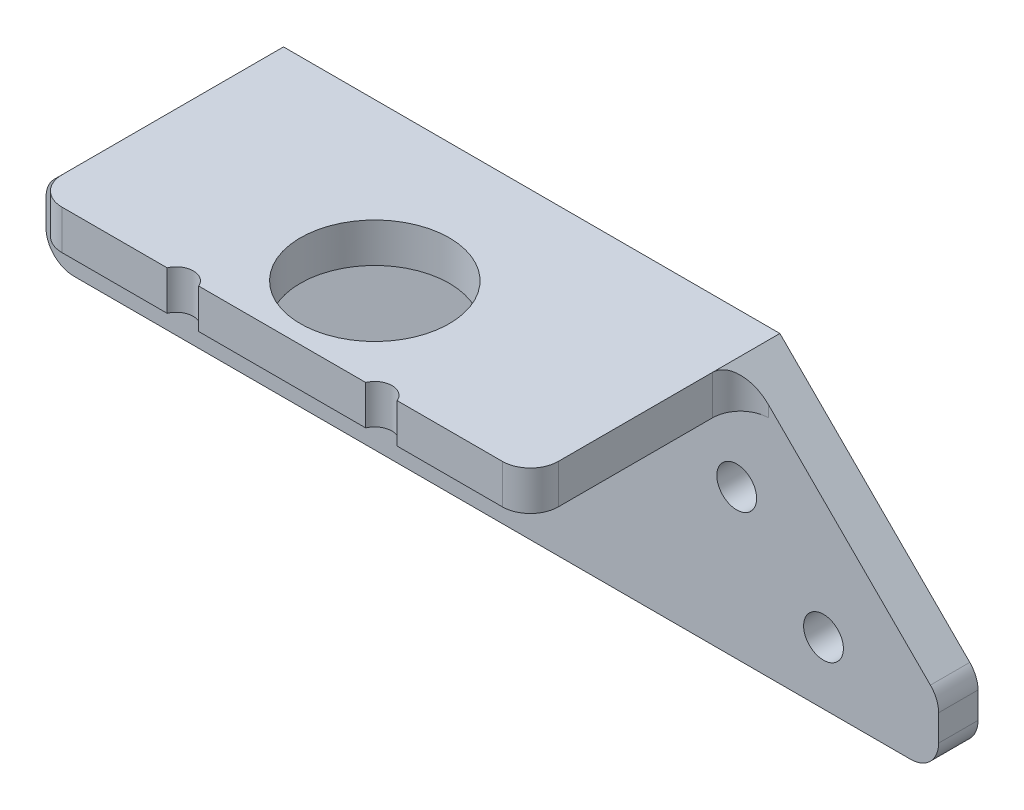
ISO-10303-21;
HEADER;
FILE_DESCRIPTION(('STEP AP214'),'2;1');
FILE_NAME('part.step','',(''),(''),'','','');
FILE_SCHEMA(('AUTOMOTIVE_DESIGN { 1 0 10303 214 1 1 1 1 }'));
ENDSEC;
DATA;
#1=APPLICATION_CONTEXT('core data for automotive mechanical design processes');
#2=APPLICATION_PROTOCOL_DEFINITION('international standard','automotive_design',2000,#1);
#3=PRODUCT_CONTEXT('',#1,'mechanical');
#4=PRODUCT('Part','Part','',(#3));
#5=PRODUCT_RELATED_PRODUCT_CATEGORY('part','',(#4));
#6=PRODUCT_DEFINITION_FORMATION('','',#4);
#7=PRODUCT_DEFINITION_CONTEXT('part definition',#1,'design');
#8=PRODUCT_DEFINITION('design','',#6,#7);
#9=PRODUCT_DEFINITION_SHAPE('','',#8);
#10=(LENGTH_UNIT() NAMED_UNIT(*) SI_UNIT(.MILLI.,.METRE.));
#11=(NAMED_UNIT(*) PLANE_ANGLE_UNIT() SI_UNIT($,.RADIAN.));
#12=(NAMED_UNIT(*) SI_UNIT($,.STERADIAN.) SOLID_ANGLE_UNIT());
#13=UNCERTAINTY_MEASURE_WITH_UNIT(LENGTH_MEASURE(1.E-05),#10,'distance_accuracy_value','');
#14=(GEOMETRIC_REPRESENTATION_CONTEXT(3) GLOBAL_UNCERTAINTY_ASSIGNED_CONTEXT((#13)) GLOBAL_UNIT_ASSIGNED_CONTEXT((#10,
#11,#12)) REPRESENTATION_CONTEXT('',''));
#15=CARTESIAN_POINT('',(0.,0.,0.));
#16=DIRECTION('',(0.,0.,1.));
#17=DIRECTION('',(1.,0.,0.));
#18=AXIS2_PLACEMENT_3D('',#15,#16,#17);
#19=CARTESIAN_POINT('',(0.,0.,24.05));
#20=DIRECTION('',(0.,0.,-1.));
#21=DIRECTION('',(-1.,0.,0.));
#22=AXIS2_PLACEMENT_3D('',#19,#20,#21);
#23=PLANE('',#22);
#24=DIRECTION('',(-1.,0.,0.));
#25=VECTOR('',#24,1.);
#26=CARTESIAN_POINT('',(-21.2299808242143,3.57187500000001,24.05));
#27=LINE('',#26,#25);
#28=CARTESIAN_POINT('',(8.8417525744906,3.57187500000001,24.05));
#29=VERTEX_POINT('',#28);
#30=CARTESIAN_POINT('',(-6.30171422291922,3.57187500000001,24.05));
#31=VERTEX_POINT('',#30);
#32=EDGE_CURVE('E196',#29,#31,#27,.T.);
#33=ORIENTED_EDGE('',*,*,#32,.T.);
#34=DIRECTION('',(0.,-1.,0.));
#35=VECTOR('',#34,1.);
#36=CARTESIAN_POINT('',(-6.30171422291922,3.57187500000001,24.05));
#37=LINE('',#36,#35);
#38=CARTESIAN_POINT('',(-6.30171422291922,0.,24.05));
#39=VERTEX_POINT('',#38);
#40=EDGE_CURVE('E11',#31,#39,#37,.T.);
#41=ORIENTED_EDGE('',*,*,#40,.T.);
#42=DIRECTION('',(1.,0.,0.));
#43=VECTOR('',#42,1.);
#44=CARTESIAN_POINT('',(23.7700191757857,0.,24.05));
#45=LINE('',#44,#43);
#46=CARTESIAN_POINT('',(8.84175257449061,0.,24.05));
#47=VERTEX_POINT('',#46);
#48=EDGE_CURVE('E205',#39,#47,#45,.T.);
#49=ORIENTED_EDGE('',*,*,#48,.T.);
#50=DIRECTION('',(0.,-1.,0.));
#51=VECTOR('',#50,1.);
#52=CARTESIAN_POINT('',(8.84175257449061,3.57187500000001,24.05));
#53=LINE('',#52,#51);
#54=EDGE_CURVE('E187',#47,#29,#53,.F.);
#55=ORIENTED_EDGE('',*,*,#54,.T.);
#56=EDGE_LOOP('',(#33,#41,#49,#55));
#57=FACE_BOUND('',#56,.T.);
#58=ADVANCED_FACE('F38',(#57),#23,.F.);
#59=CARTESIAN_POINT('',(21.2300191757857,3.57187500000001,24.05));
#60=VERTEX_POINT('',#59);
#61=CARTESIAN_POINT('',(11.6982857770808,3.57187500000001,24.05));
#62=VERTEX_POINT('',#61);
#63=EDGE_CURVE('E194',#60,#62,#27,.T.);
#64=ORIENTED_EDGE('',*,*,#63,.T.);
#65=DIRECTION('',(0.,-1.,0.));
#66=VECTOR('',#65,1.);
#67=CARTESIAN_POINT('',(11.6982857770808,3.57187500000001,24.05));
#68=LINE('',#67,#66);
#69=CARTESIAN_POINT('',(11.6982857770808,0.,24.05));
#70=VERTEX_POINT('',#69);
#71=EDGE_CURVE('E180',#62,#70,#68,.T.);
#72=ORIENTED_EDGE('',*,*,#71,.T.);
#73=CARTESIAN_POINT('',(21.2300191757857,0.,24.05));
#74=VERTEX_POINT('',#73);
#75=EDGE_CURVE('E202',#70,#74,#45,.T.);
#76=ORIENTED_EDGE('',*,*,#75,.T.);
#77=DIRECTION('',(0.,1.,0.));
#78=VECTOR('',#77,1.);
#79=CARTESIAN_POINT('',(21.2300191757857,0.,24.05));
#80=LINE('',#79,#78);
#81=EDGE_CURVE('E201',#74,#60,#80,.T.);
#82=ORIENTED_EDGE('',*,*,#81,.T.);
#83=EDGE_LOOP('',(#64,#72,#76,#82));
#84=FACE_BOUND('',#83,.T.);
#85=ADVANCED_FACE('F199',(#84),#23,.F.);
#86=CARTESIAN_POINT('',(-19.5308498825586,-11.8335769599995,5.));
#87=DIRECTION('',(0.,0.,1.));
#88=DIRECTION('',(1.,0.,0.));
#89=AXIS2_PLACEMENT_3D('',#86,#87,#88);
#90=PLANE('',#89);
#91=CARTESIAN_POINT('',(-28.7554354536702,-14.7298869747387,5.));
#92=DIRECTION('',(0.,0.,1.));
#93=DIRECTION('',(1.,0.,0.));
#94=AXIS2_PLACEMENT_3D('',#91,#92,#93);
#95=CIRCLE('',#94,1.8034);
#96=CARTESIAN_POINT('',(-26.9520354536702,-14.7298869747387,5.));
#97=VERTEX_POINT('',#96);
#98=EDGE_CURVE('E269',#97,#97,#95,.T.);
#99=ORIENTED_EDGE('',*,*,#98,.F.);
#100=EDGE_LOOP('',(#99));
#101=FACE_BOUND('',#100,.T.);
#102=CARTESIAN_POINT('',(-20.8887310916135,-6.86318261268222,5.));
#103=DIRECTION('',(0.,0.,1.));
#104=DIRECTION('',(1.,0.,0.));
#105=AXIS2_PLACEMENT_3D('',#102,#103,#104);
#106=CIRCLE('',#105,1.8034);
#107=CARTESIAN_POINT('',(-19.0853310916135,-6.86318261268222,5.));
#108=VERTEX_POINT('',#107);
#109=EDGE_CURVE('E266',#108,#108,#106,.T.);
#110=ORIENTED_EDGE('',*,*,#109,.F.);
#111=EDGE_LOOP('',(#110));
#112=FACE_BOUND('',#111,.T.);
#113=CARTESIAN_POINT('',(23.4287694431852,-6.86318261268224,5.));
#114=DIRECTION('',(0.,0.,1.));
#115=DIRECTION('',(1.,0.,0.));
#116=AXIS2_PLACEMENT_3D('',#113,#114,#115);
#117=CIRCLE('',#116,1.8034);
#118=CARTESIAN_POINT('',(25.2321694431852,-6.86318261268224,5.));
#119=VERTEX_POINT('',#118);
#120=EDGE_CURVE('E260',#119,#119,#117,.T.);
#121=ORIENTED_EDGE('',*,*,#120,.F.);
#122=EDGE_LOOP('',(#121));
#123=FACE_BOUND('',#122,.T.);
#124=CARTESIAN_POINT('',(31.2954738052418,-14.7298869747388,5.));
#125=DIRECTION('',(0.,0.,1.));
#126=DIRECTION('',(1.,0.,0.));
#127=AXIS2_PLACEMENT_3D('',#124,#125,#126);
#128=CIRCLE('',#127,1.8034);
#129=CARTESIAN_POINT('',(33.0988738052418,-14.7298869747388,5.));
#130=VERTEX_POINT('',#129);
#131=EDGE_CURVE('E254',#130,#130,#128,.T.);
#132=ORIENTED_EDGE('',*,*,#131,.F.);
#133=EDGE_LOOP('',(#132));
#134=FACE_BOUND('',#133,.T.);
#135=DIRECTION('',(1.,0.,0.));
#136=VECTOR('',#135,1.);
#137=CARTESIAN_POINT('',(23.7700191757857,0.,5.));
#138=LINE('',#137,#136);
#139=CARTESIAN_POINT('',(-23.7699808242143,0.,5.));
#140=VERTEX_POINT('',#139);
#141=CARTESIAN_POINT('',(26.3100191757857,0.,5.));
#142=VERTEX_POINT('',#141);
#143=EDGE_CURVE('E305',#140,#142,#138,.T.);
#144=ORIENTED_EDGE('',*,*,#143,.F.);
#145=DIRECTION('',(0.,-1.,0.));
#146=VECTOR('',#145,1.);
#147=CARTESIAN_POINT('',(-23.7699808242143,-11.8335769599995,5.));
#148=LINE('',#147,#146);
#149=CARTESIAN_POINT('',(-23.7699808242143,1.031875,5.));
#150=VERTEX_POINT('',#149);
#151=EDGE_CURVE('E350',#140,#150,#148,.F.);
#152=ORIENTED_EDGE('',*,*,#151,.T.);
#153=DIRECTION('',(-0.707106781186546,-0.707106781186549,0.));
#154=VECTOR('',#153,1.);
#155=CARTESIAN_POINT('',(-21.2299808242143,3.57187500000001,5.));
#156=LINE('',#155,#154);
#157=CARTESIAN_POINT('',(-38.4465442905663,-13.644688466352,5.));
#158=VERTEX_POINT('',#157);
#159=EDGE_CURVE('E224',#150,#158,#156,.T.);
#160=ORIENTED_EDGE('',*,*,#159,.T.);
#161=CARTESIAN_POINT('',(-36.6504930663524,-15.4407396905659,5.));
#162=DIRECTION('',(0.,0.,1.));
#163=DIRECTION('',(1.,0.,0.));
#164=AXIS2_PLACEMENT_3D('',#161,#162,#163);
#165=CIRCLE('',#164,2.54);
#166=CARTESIAN_POINT('',(-39.1904930663524,-15.4407396905659,5.));
#167=VERTEX_POINT('',#166);
#168=EDGE_CURVE('E345',#158,#167,#165,.T.);
#169=ORIENTED_EDGE('',*,*,#168,.T.);
#170=DIRECTION('',(0.,-1.,0.));
#171=VECTOR('',#170,1.);
#172=CARTESIAN_POINT('',(-39.1904930663524,-14.3886372421382,5.));
#173=LINE('',#172,#171);
#174=CARTESIAN_POINT('',(-39.1904930663524,-17.82736397448,5.));
#175=VERTEX_POINT('',#174);
#176=EDGE_CURVE('E220',#167,#175,#173,.T.);
#177=ORIENTED_EDGE('',*,*,#176,.T.);
#178=CARTESIAN_POINT('',(-36.6504930663524,-17.82736397448,5.));
#179=DIRECTION('',(0.,0.,1.));
#180=DIRECTION('',(1.,0.,0.));
#181=AXIS2_PLACEMENT_3D('',#178,#179,#180);
#182=CIRCLE('',#181,2.54);
#183=CARTESIAN_POINT('',(-36.6504930663524,-20.36736397448,5.));
#184=VERTEX_POINT('',#183);
#185=EDGE_CURVE('E343',#175,#184,#182,.T.);
#186=ORIENTED_EDGE('',*,*,#185,.T.);
#187=DIRECTION('',(1.,0.,0.));
#188=VECTOR('',#187,1.);
#189=CARTESIAN_POINT('',(-39.1904930663524,-20.36736397448,5.));
#190=LINE('',#189,#188);
#191=CARTESIAN_POINT('',(39.1905314179241,-20.36736397448,5.));
#192=VERTEX_POINT('',#191);
#193=EDGE_CURVE('E233',#184,#192,#190,.T.);
#194=ORIENTED_EDGE('',*,*,#193,.T.);
#195=CARTESIAN_POINT('',(39.1905314179241,-17.82736397448,5.));
#196=DIRECTION('',(0.,0.,1.));
#197=DIRECTION('',(1.,0.,0.));
#198=AXIS2_PLACEMENT_3D('',#195,#196,#197);
#199=CIRCLE('',#198,2.54);
#200=CARTESIAN_POINT('',(41.7305314179241,-17.82736397448,5.));
#201=VERTEX_POINT('',#200);
#202=EDGE_CURVE('E339',#192,#201,#199,.T.);
#203=ORIENTED_EDGE('',*,*,#202,.T.);
#204=DIRECTION('',(0.,1.,0.));
#205=VECTOR('',#204,1.);
#206=CARTESIAN_POINT('',(41.7305314179241,-20.36736397448,5.));
#207=LINE('',#206,#205);
#208=CARTESIAN_POINT('',(41.7305314179241,-15.4407396905659,5.));
#209=VERTEX_POINT('',#208);
#210=EDGE_CURVE('E230',#201,#209,#207,.T.);
#211=ORIENTED_EDGE('',*,*,#210,.T.);
#212=CARTESIAN_POINT('',(39.1905314179241,-15.4407396905659,5.));
#213=DIRECTION('',(0.,0.,1.));
#214=DIRECTION('',(1.,0.,0.));
#215=AXIS2_PLACEMENT_3D('',#212,#213,#214);
#216=CIRCLE('',#215,2.54);
#217=CARTESIAN_POINT('',(40.9865826421379,-13.644688466352,5.));
#218=VERTEX_POINT('',#217);
#219=EDGE_CURVE('E341',#209,#218,#216,.T.);
#220=ORIENTED_EDGE('',*,*,#219,.T.);
#221=DIRECTION('',(-0.707106781186551,0.707106781186543,0.));
#222=VECTOR('',#221,1.);
#223=CARTESIAN_POINT('',(23.7700191757857,3.57187500000001,5.));
#224=LINE('',#223,#222);
#225=CARTESIAN_POINT('',(26.3100191757857,1.03187500000003,5.));
#226=VERTEX_POINT('',#225);
#227=EDGE_CURVE('E227',#218,#226,#224,.T.);
#228=ORIENTED_EDGE('',*,*,#227,.T.);
#229=DIRECTION('',(0.,1.,0.));
#230=VECTOR('',#229,1.);
#231=CARTESIAN_POINT('',(26.3100191757857,-11.8335769599995,5.));
#232=LINE('',#231,#230);
#233=EDGE_CURVE('E347',#226,#142,#232,.F.);
#234=ORIENTED_EDGE('',*,*,#233,.T.);
#235=EDGE_LOOP('',(#144,#152,#160,#169,#177,#186,#194,#203,#211,#220,#228,#234));
#236=FACE_BOUND('',#235,.T.);
#237=ADVANCED_FACE('F407',(#101,#112,#123,#134,#236),#90,.T.);
#238=CARTESIAN_POINT('',(23.7700191757857,3.57187500000001,24.05));
#239=DIRECTION('',(-1.,0.,0.));
#240=DIRECTION('',(0.,0.,1.));
#241=AXIS2_PLACEMENT_3D('',#238,#239,#240);
#242=PLANE('',#241);
#243=DIRECTION('',(0.,0.,-1.));
#244=VECTOR('',#243,1.);
#245=CARTESIAN_POINT('',(23.7700191757857,3.57187500000001,24.05));
#246=LINE('',#245,#244);
#247=CARTESIAN_POINT('',(23.7700191757857,3.57187500000001,21.51));
#248=VERTEX_POINT('',#247);
#249=CARTESIAN_POINT('',(23.7700191757857,3.57187500000001,7.54));
#250=VERTEX_POINT('',#249);
#251=EDGE_CURVE('E308',#248,#250,#246,.T.);
#252=ORIENTED_EDGE('',*,*,#251,.F.);
#253=DIRECTION('',(0.,1.,0.));
#254=VECTOR('',#253,1.);
#255=CARTESIAN_POINT('',(23.7700191757857,3.57187500000001,21.51));
#256=LINE('',#255,#254);
#257=CARTESIAN_POINT('',(23.7700191757857,0.,21.51));
#258=VERTEX_POINT('',#257);
#259=EDGE_CURVE('E327',#248,#258,#256,.F.);
#260=ORIENTED_EDGE('',*,*,#259,.T.);
#261=DIRECTION('',(0.,0.,-1.));
#262=VECTOR('',#261,1.);
#263=CARTESIAN_POINT('',(23.7700191757857,0.,24.05));
#264=LINE('',#263,#262);
#265=CARTESIAN_POINT('',(23.7700191757857,0.,7.54000000000001));
#266=VERTEX_POINT('',#265);
#267=EDGE_CURVE('E303',#258,#266,#264,.T.);
#268=ORIENTED_EDGE('',*,*,#267,.T.);
#269=DIRECTION('',(0.,1.,0.));
#270=VECTOR('',#269,1.);
#271=CARTESIAN_POINT('',(23.7700191757857,3.57187500000001,7.54));
#272=LINE('',#271,#270);
#273=EDGE_CURVE('E324',#266,#250,#272,.T.);
#274=ORIENTED_EDGE('',*,*,#273,.T.);
#275=EDGE_LOOP('',(#252,#260,#268,#274));
#276=FACE_BOUND('',#275,.T.);
#277=ADVANCED_FACE('F415',(#276),#242,.F.);
#278=CARTESIAN_POINT('',(-21.2299808242143,3.57187500000001,24.05));
#279=DIRECTION('',(0.,-1.,0.));
#280=DIRECTION('',(0.,0.,-1.));
#281=AXIS2_PLACEMENT_3D('',#278,#279,#280);
#282=PLANE('',#281);
#283=CARTESIAN_POINT('',(1.2700191757857,3.57187500000001,15.652125));
#284=DIRECTION('',(0.,-1.,0.));
#285=DIRECTION('',(0.,0.,-1.));
#286=AXIS2_PLACEMENT_3D('',#283,#284,#285);
#287=CIRCLE('',#286,6.75);
#288=CARTESIAN_POINT('',(1.2700191757857,3.57187500000001,8.902125));
#289=VERTEX_POINT('',#288);
#290=EDGE_CURVE('E277',#289,#289,#287,.T.);
#291=ORIENTED_EDGE('',*,*,#290,.T.);
#292=EDGE_LOOP('',(#291));
#293=FACE_BOUND('',#292,.T.);
#294=CARTESIAN_POINT('',(-9.15824742550939,3.57187500000001,24.05));
#295=VERTEX_POINT('',#294);
#296=CARTESIAN_POINT('',(-18.6899808242143,3.57187500000001,24.05));
#297=VERTEX_POINT('',#296);
#298=EDGE_CURVE('E204',#295,#297,#27,.T.);
#299=ORIENTED_EDGE('',*,*,#298,.F.);
#300=CARTESIAN_POINT('',(-7.72998082421431,3.57187500000001,24.652125));
#301=DIRECTION('',(0.,-1.,0.));
#302=DIRECTION('',(0.,0.,-1.));
#303=AXIS2_PLACEMENT_3D('',#300,#301,#302);
#304=CIRCLE('',#303,1.55);
#305=EDGE_CURVE('E54',#295,#31,#304,.T.);
#306=ORIENTED_EDGE('',*,*,#305,.T.);
#307=ORIENTED_EDGE('',*,*,#32,.F.);
#308=CARTESIAN_POINT('',(10.2700191757857,3.57187500000001,24.652125));
#309=DIRECTION('',(0.,-1.,0.));
#310=DIRECTION('',(0.,0.,-1.));
#311=AXIS2_PLACEMENT_3D('',#308,#309,#310);
#312=CIRCLE('',#311,1.55);
#313=EDGE_CURVE('E62',#29,#62,#312,.T.);
#314=ORIENTED_EDGE('',*,*,#313,.T.);
#315=ORIENTED_EDGE('',*,*,#63,.F.);
#316=CARTESIAN_POINT('',(21.2300191757857,3.57187500000001,21.51));
#317=DIRECTION('',(0.,-1.,0.));
#318=DIRECTION('',(0.,0.,-1.));
#319=AXIS2_PLACEMENT_3D('',#316,#317,#318);
#320=CIRCLE('',#319,2.54);
#321=EDGE_CURVE('E322',#60,#248,#320,.F.);
#322=ORIENTED_EDGE('',*,*,#321,.T.);
#323=ORIENTED_EDGE('',*,*,#251,.T.);
#324=DIRECTION('',(0.,0.,1.));
#325=VECTOR('',#324,1.);
#326=CARTESIAN_POINT('',(23.7700191757857,3.57187500000001,1.428125));
#327=LINE('',#326,#325);
#328=CARTESIAN_POINT('',(23.7700191757857,3.57187500000001,1.428125));
#329=VERTEX_POINT('',#328);
#330=EDGE_CURVE('E213',#329,#250,#327,.T.);
#331=ORIENTED_EDGE('',*,*,#330,.F.);
#332=DIRECTION('',(-1.,0.,0.));
#333=VECTOR('',#332,1.);
#334=CARTESIAN_POINT('',(23.7700191757857,3.57187500000001,1.428125));
#335=LINE('',#334,#333);
#336=CARTESIAN_POINT('',(-21.2299808242143,3.57187500000001,1.428125));
#337=VERTEX_POINT('',#336);
#338=EDGE_CURVE('E242',#329,#337,#335,.T.);
#339=ORIENTED_EDGE('',*,*,#338,.T.);
#340=DIRECTION('',(0.,0.,1.));
#341=VECTOR('',#340,1.);
#342=CARTESIAN_POINT('',(-21.2299808242143,3.57187500000001,1.428125));
#343=LINE('',#342,#341);
#344=CARTESIAN_POINT('',(-21.2299808242143,3.57187500000001,7.54000000000001));
#345=VERTEX_POINT('',#344);
#346=EDGE_CURVE('E209',#337,#345,#343,.T.);
#347=ORIENTED_EDGE('',*,*,#346,.T.);
#348=DIRECTION('',(0.,0.,-1.));
#349=VECTOR('',#348,1.);
#350=CARTESIAN_POINT('',(-21.2299808242143,3.57187500000001,24.05));
#351=LINE('',#350,#349);
#352=CARTESIAN_POINT('',(-21.2299808242143,3.57187500000001,21.51));
#353=VERTEX_POINT('',#352);
#354=EDGE_CURVE('E314',#353,#345,#351,.T.);
#355=ORIENTED_EDGE('',*,*,#354,.F.);
#356=CARTESIAN_POINT('',(-18.6899808242143,3.57187500000001,21.51));
#357=DIRECTION('',(0.,-1.,0.));
#358=DIRECTION('',(0.,0.,-1.));
#359=AXIS2_PLACEMENT_3D('',#356,#357,#358);
#360=CIRCLE('',#359,2.54);
#361=EDGE_CURVE('E320',#353,#297,#360,.F.);
#362=ORIENTED_EDGE('',*,*,#361,.T.);
#363=EDGE_LOOP('',(#299,#306,#307,#314,#315,#322,#323,#331,#339,#347,#355,#362));
#364=FACE_BOUND('',#363,.T.);
#365=ADVANCED_FACE('F193',(#293,#364),#282,.F.);
#366=CARTESIAN_POINT('',(-21.2299808242143,0.,24.05));
#367=DIRECTION('',(1.,0.,0.));
#368=DIRECTION('',(0.,0.,-1.));
#369=AXIS2_PLACEMENT_3D('',#366,#367,#368);
#370=PLANE('',#369);
#371=DIRECTION('',(0.,0.,-1.));
#372=VECTOR('',#371,1.);
#373=CARTESIAN_POINT('',(-21.2299808242143,0.,24.05));
#374=LINE('',#373,#372);
#375=CARTESIAN_POINT('',(-21.2299808242143,0.,21.51));
#376=VERTEX_POINT('',#375);
#377=CARTESIAN_POINT('',(-21.2299808242143,0.,7.54000000000001));
#378=VERTEX_POINT('',#377);
#379=EDGE_CURVE('E311',#376,#378,#374,.T.);
#380=ORIENTED_EDGE('',*,*,#379,.F.);
#381=DIRECTION('',(0.,-1.,0.));
#382=VECTOR('',#381,1.);
#383=CARTESIAN_POINT('',(-21.2299808242143,0.,21.51));
#384=LINE('',#383,#382);
#385=EDGE_CURVE('E337',#376,#353,#384,.F.);
#386=ORIENTED_EDGE('',*,*,#385,.T.);
#387=ORIENTED_EDGE('',*,*,#354,.T.);
#388=DIRECTION('',(0.,-1.,0.));
#389=VECTOR('',#388,1.);
#390=CARTESIAN_POINT('',(-21.2299808242143,0.,7.54));
#391=LINE('',#390,#389);
#392=EDGE_CURVE('E334',#345,#378,#391,.T.);
#393=ORIENTED_EDGE('',*,*,#392,.T.);
#394=EDGE_LOOP('',(#380,#386,#387,#393));
#395=FACE_BOUND('',#394,.T.);
#396=ADVANCED_FACE('F296',(#395),#370,.F.);
#397=CARTESIAN_POINT('',(23.7700191757857,0.,24.05));
#398=DIRECTION('',(0.,1.,0.));
#399=DIRECTION('',(0.,0.,1.));
#400=AXIS2_PLACEMENT_3D('',#397,#398,#399);
#401=PLANE('',#400);
#402=CARTESIAN_POINT('',(1.2700191757857,0.,15.652125));
#403=DIRECTION('',(0.,1.,0.));
#404=DIRECTION('',(0.,0.,1.));
#405=AXIS2_PLACEMENT_3D('',#402,#403,#404);
#406=CIRCLE('',#405,6.75);
#407=CARTESIAN_POINT('',(1.2700191757857,0.,22.402125));
#408=VERTEX_POINT('',#407);
#409=EDGE_CURVE('E42',#408,#408,#406,.T.);
#410=ORIENTED_EDGE('',*,*,#409,.T.);
#411=EDGE_LOOP('',(#410));
#412=FACE_BOUND('',#411,.T.);
#413=ORIENTED_EDGE('',*,*,#48,.F.);
#414=CARTESIAN_POINT('',(-7.72998082421431,0.,24.652125));
#415=DIRECTION('',(0.,1.,0.));
#416=DIRECTION('',(0.,0.,1.));
#417=AXIS2_PLACEMENT_3D('',#414,#415,#416);
#418=CIRCLE('',#417,1.55);
#419=CARTESIAN_POINT('',(-9.15824742550939,0.,24.05));
#420=VERTEX_POINT('',#419);
#421=EDGE_CURVE('E274',#39,#420,#418,.T.);
#422=ORIENTED_EDGE('',*,*,#421,.T.);
#423=CARTESIAN_POINT('',(-18.6899808242143,0.,24.05));
#424=VERTEX_POINT('',#423);
#425=EDGE_CURVE('E207',#424,#420,#45,.T.);
#426=ORIENTED_EDGE('',*,*,#425,.F.);
#427=CARTESIAN_POINT('',(-18.6899808242143,0.,21.51));
#428=DIRECTION('',(0.,1.,0.));
#429=DIRECTION('',(0.,0.,1.));
#430=AXIS2_PLACEMENT_3D('',#427,#428,#429);
#431=CIRCLE('',#430,2.54);
#432=EDGE_CURVE('E329',#424,#376,#431,.F.);
#433=ORIENTED_EDGE('',*,*,#432,.T.);
#434=ORIENTED_EDGE('',*,*,#379,.T.);
#435=CARTESIAN_POINT('',(-23.7699808242143,0.,7.54));
#436=DIRECTION('',(0.,1.,0.));
#437=DIRECTION('',(0.,0.,1.));
#438=AXIS2_PLACEMENT_3D('',#435,#436,#437);
#439=CIRCLE('',#438,2.54);
#440=EDGE_CURVE('E380',#378,#140,#439,.T.);
#441=ORIENTED_EDGE('',*,*,#440,.T.);
#442=ORIENTED_EDGE('',*,*,#143,.T.);
#443=CARTESIAN_POINT('',(26.3100191757857,0.,7.54));
#444=DIRECTION('',(0.,1.,0.));
#445=DIRECTION('',(0.,0.,1.));
#446=AXIS2_PLACEMENT_3D('',#443,#444,#445);
#447=CIRCLE('',#446,2.54);
#448=EDGE_CURVE('E388',#142,#266,#447,.T.);
#449=ORIENTED_EDGE('',*,*,#448,.T.);
#450=ORIENTED_EDGE('',*,*,#267,.F.);
#451=CARTESIAN_POINT('',(21.2300191757857,0.,21.51));
#452=DIRECTION('',(0.,1.,0.));
#453=DIRECTION('',(0.,0.,1.));
#454=AXIS2_PLACEMENT_3D('',#451,#452,#453);
#455=CIRCLE('',#454,2.54);
#456=EDGE_CURVE('E331',#258,#74,#455,.F.);
#457=ORIENTED_EDGE('',*,*,#456,.T.);
#458=ORIENTED_EDGE('',*,*,#75,.F.);
#459=CARTESIAN_POINT('',(10.2700191757857,0.,24.652125));
#460=DIRECTION('',(0.,1.,0.));
#461=DIRECTION('',(0.,0.,1.));
#462=AXIS2_PLACEMENT_3D('',#459,#460,#461);
#463=CIRCLE('',#462,1.55);
#464=EDGE_CURVE('E183',#70,#47,#463,.T.);
#465=ORIENTED_EDGE('',*,*,#464,.T.);
#466=EDGE_LOOP('',(#413,#422,#426,#433,#434,#441,#442,#449,#450,#457,#458,#465));
#467=FACE_BOUND('',#466,.T.);
#468=ADVANCED_FACE('F292',(#412,#467),#401,.F.);
#469=ORIENTED_EDGE('',*,*,#425,.T.);
#470=DIRECTION('',(0.,-1.,0.));
#471=VECTOR('',#470,1.);
#472=CARTESIAN_POINT('',(-9.15824742550939,3.57187500000001,24.05));
#473=LINE('',#472,#471);
#474=EDGE_CURVE('E47',#420,#295,#473,.F.);
#475=ORIENTED_EDGE('',*,*,#474,.T.);
#476=ORIENTED_EDGE('',*,*,#298,.T.);
#477=DIRECTION('',(0.,-1.,0.));
#478=VECTOR('',#477,1.);
#479=CARTESIAN_POINT('',(-18.6899808242143,0.,24.05));
#480=LINE('',#479,#478);
#481=EDGE_CURVE('E307',#297,#424,#480,.T.);
#482=ORIENTED_EDGE('',*,*,#481,.T.);
#483=EDGE_LOOP('',(#469,#475,#476,#482));
#484=FACE_BOUND('',#483,.T.);
#485=ADVANCED_FACE('F295',(#484),#23,.F.);
#486=CARTESIAN_POINT('',(-39.1904930663524,-20.36736397448,1.428125));
#487=DIRECTION('',(0.,-1.,0.));
#488=DIRECTION('',(0.,0.,-1.));
#489=AXIS2_PLACEMENT_3D('',#486,#487,#488);
#490=PLANE('',#489);
#491=ORIENTED_EDGE('',*,*,#193,.F.);
#492=DIRECTION('',(0.,0.,1.));
#493=VECTOR('',#492,1.);
#494=CARTESIAN_POINT('',(-36.6504930663524,-20.36736397448,1.428125));
#495=LINE('',#494,#493);
#496=CARTESIAN_POINT('',(-36.6504930663524,-20.36736397448,1.428125));
#497=VERTEX_POINT('',#496);
#498=EDGE_CURVE('E371',#184,#497,#495,.F.);
#499=ORIENTED_EDGE('',*,*,#498,.T.);
#500=DIRECTION('',(1.,0.,0.));
#501=VECTOR('',#500,1.);
#502=CARTESIAN_POINT('',(-39.1904930663524,-20.36736397448,1.428125));
#503=LINE('',#502,#501);
#504=CARTESIAN_POINT('',(39.1905314179241,-20.36736397448,1.428125));
#505=VERTEX_POINT('',#504);
#506=EDGE_CURVE('E223',#497,#505,#503,.T.);
#507=ORIENTED_EDGE('',*,*,#506,.T.);
#508=DIRECTION('',(0.,0.,1.));
#509=VECTOR('',#508,1.);
#510=CARTESIAN_POINT('',(39.1905314179241,-20.36736397448,1.428125));
#511=LINE('',#510,#509);
#512=EDGE_CURVE('E368',#505,#192,#511,.T.);
#513=ORIENTED_EDGE('',*,*,#512,.T.);
#514=EDGE_LOOP('',(#491,#499,#507,#513));
#515=FACE_BOUND('',#514,.T.);
#516=ADVANCED_FACE('F441',(#515),#490,.T.);
#517=CARTESIAN_POINT('',(-39.1904930663524,-14.3886372421382,1.428125));
#518=DIRECTION('',(-1.,0.,0.));
#519=DIRECTION('',(0.,0.,1.));
#520=AXIS2_PLACEMENT_3D('',#517,#518,#519);
#521=PLANE('',#520);
#522=ORIENTED_EDGE('',*,*,#176,.F.);
#523=DIRECTION('',(0.,0.,1.));
#524=VECTOR('',#523,1.);
#525=CARTESIAN_POINT('',(-39.1904930663524,-15.4407396905659,1.428125));
#526=LINE('',#525,#524);
#527=CARTESIAN_POINT('',(-39.1904930663524,-15.4407396905659,1.428125));
#528=VERTEX_POINT('',#527);
#529=EDGE_CURVE('E358',#167,#528,#526,.F.);
#530=ORIENTED_EDGE('',*,*,#529,.T.);
#531=DIRECTION('',(0.,-1.,0.));
#532=VECTOR('',#531,1.);
#533=CARTESIAN_POINT('',(-39.1904930663524,-14.3886372421382,1.428125));
#534=LINE('',#533,#532);
#535=CARTESIAN_POINT('',(-39.1904930663524,-17.82736397448,1.428125));
#536=VERTEX_POINT('',#535);
#537=EDGE_CURVE('E218',#528,#536,#534,.T.);
#538=ORIENTED_EDGE('',*,*,#537,.T.);
#539=DIRECTION('',(0.,0.,1.));
#540=VECTOR('',#539,1.);
#541=CARTESIAN_POINT('',(-39.1904930663524,-17.82736397448,1.428125));
#542=LINE('',#541,#540);
#543=EDGE_CURVE('E355',#536,#175,#542,.T.);
#544=ORIENTED_EDGE('',*,*,#543,.T.);
#545=EDGE_LOOP('',(#522,#530,#538,#544));
#546=FACE_BOUND('',#545,.T.);
#547=ADVANCED_FACE('F445',(#546),#521,.T.);
#548=CARTESIAN_POINT('',(-21.2299808242143,3.57187500000001,1.428125));
#549=DIRECTION('',(-0.707106781186549,0.707106781186546,0.));
#550=DIRECTION('',(-0.707106781186546,-0.707106781186549,0.));
#551=AXIS2_PLACEMENT_3D('',#548,#549,#550);
#552=PLANE('',#551);
#553=DIRECTION('',(-0.707106781186546,-0.707106781186549,0.));
#554=VECTOR('',#553,1.);
#555=CARTESIAN_POINT('',(-21.2299808242143,3.57187500000001,1.428125));
#556=LINE('',#555,#554);
#557=CARTESIAN_POINT('',(-38.4465442905663,-13.644688466352,1.428125));
#558=VERTEX_POINT('',#557);
#559=EDGE_CURVE('E239',#337,#558,#556,.T.);
#560=ORIENTED_EDGE('',*,*,#559,.T.);
#561=DIRECTION('',(0.,0.,1.));
#562=VECTOR('',#561,1.);
#563=CARTESIAN_POINT('',(-38.4465442905663,-13.644688466352,1.428125));
#564=LINE('',#563,#562);
#565=EDGE_CURVE('E352',#558,#158,#564,.T.);
#566=ORIENTED_EDGE('',*,*,#565,.T.);
#567=ORIENTED_EDGE('',*,*,#159,.F.);
#568=CARTESIAN_POINT('',(-23.7699808242143,1.03187499999999,7.54));
#569=DIRECTION('',(-0.707106781186549,0.707106781186546,0.));
#570=DIRECTION('',(-0.707106781186546,-0.707106781186549,0.));
#571=AXIS2_PLACEMENT_3D('',#568,#569,#570);
#572=ELLIPSE('',#571,3.59210244842767,2.54);
#573=EDGE_CURVE('E383',#150,#345,#572,.F.);
#574=ORIENTED_EDGE('',*,*,#573,.T.);
#575=ORIENTED_EDGE('',*,*,#346,.F.);
#576=EDGE_LOOP('',(#560,#566,#567,#574,#575));
#577=FACE_BOUND('',#576,.T.);
#578=ADVANCED_FACE('F450',(#577),#552,.T.);
#579=CARTESIAN_POINT('',(23.7700191757857,3.57187500000001,1.428125));
#580=DIRECTION('',(0.707106781186544,0.707106781186552,0.));
#581=DIRECTION('',(-0.707106781186552,0.707106781186544,0.));
#582=AXIS2_PLACEMENT_3D('',#579,#580,#581);
#583=PLANE('',#582);
#584=ORIENTED_EDGE('',*,*,#227,.F.);
#585=DIRECTION('',(0.,0.,1.));
#586=VECTOR('',#585,1.);
#587=CARTESIAN_POINT('',(40.9865826421379,-13.644688466352,1.428125));
#588=LINE('',#587,#586);
#589=CARTESIAN_POINT('',(40.9865826421379,-13.644688466352,1.428125));
#590=VERTEX_POINT('',#589);
#591=EDGE_CURVE('E378',#218,#590,#588,.F.);
#592=ORIENTED_EDGE('',*,*,#591,.T.);
#593=DIRECTION('',(-0.707106781186551,0.707106781186543,0.));
#594=VECTOR('',#593,1.);
#595=CARTESIAN_POINT('',(23.7700191757857,3.57187500000001,1.428125));
#596=LINE('',#595,#594);
#597=EDGE_CURVE('E244',#590,#329,#596,.T.);
#598=ORIENTED_EDGE('',*,*,#597,.T.);
#599=ORIENTED_EDGE('',*,*,#330,.T.);
#600=CARTESIAN_POINT('',(26.3100191757857,1.03187500000003,7.54));
#601=DIRECTION('',(0.707106781186544,0.707106781186552,0.));
#602=DIRECTION('',(-0.707106781186552,0.707106781186544,0.));
#603=AXIS2_PLACEMENT_3D('',#600,#601,#602);
#604=ELLIPSE('',#603,3.59210244842764,2.54);
#605=EDGE_CURVE('E386',#250,#226,#604,.F.);
#606=ORIENTED_EDGE('',*,*,#605,.T.);
#607=EDGE_LOOP('',(#584,#592,#598,#599,#606));
#608=FACE_BOUND('',#607,.T.);
#609=ADVANCED_FACE('F459',(#608),#583,.T.);
#610=CARTESIAN_POINT('',(41.7305314179241,-20.36736397448,1.428125));
#611=DIRECTION('',(1.,0.,0.));
#612=DIRECTION('',(0.,0.,-1.));
#613=AXIS2_PLACEMENT_3D('',#610,#611,#612);
#614=PLANE('',#613);
#615=DIRECTION('',(0.,1.,0.));
#616=VECTOR('',#615,1.);
#617=CARTESIAN_POINT('',(41.7305314179241,-20.36736397448,1.428125));
#618=LINE('',#617,#616);
#619=CARTESIAN_POINT('',(41.7305314179241,-17.82736397448,1.428125));
#620=VERTEX_POINT('',#619);
#621=CARTESIAN_POINT('',(41.7305314179241,-15.4407396905659,1.428125));
#622=VERTEX_POINT('',#621);
#623=EDGE_CURVE('E246',#620,#622,#618,.T.);
#624=ORIENTED_EDGE('',*,*,#623,.T.);
#625=DIRECTION('',(0.,0.,1.));
#626=VECTOR('',#625,1.);
#627=CARTESIAN_POINT('',(41.7305314179241,-15.4407396905659,1.428125));
#628=LINE('',#627,#626);
#629=EDGE_CURVE('E375',#622,#209,#628,.T.);
#630=ORIENTED_EDGE('',*,*,#629,.T.);
#631=ORIENTED_EDGE('',*,*,#210,.F.);
#632=DIRECTION('',(0.,0.,1.));
#633=VECTOR('',#632,1.);
#634=CARTESIAN_POINT('',(41.7305314179241,-17.82736397448,1.428125));
#635=LINE('',#634,#633);
#636=EDGE_CURVE('E373',#201,#620,#635,.F.);
#637=ORIENTED_EDGE('',*,*,#636,.T.);
#638=EDGE_LOOP('',(#624,#630,#631,#637));
#639=FACE_BOUND('',#638,.T.);
#640=ADVANCED_FACE('F455',(#639),#614,.T.);
#641=CARTESIAN_POINT('',(-19.5308498825586,-11.8335769599995,1.428125));
#642=DIRECTION('',(0.,0.,1.));
#643=DIRECTION('',(1.,0.,0.));
#644=AXIS2_PLACEMENT_3D('',#641,#642,#643);
#645=PLANE('',#644);
#646=CARTESIAN_POINT('',(-28.7554354536702,-14.7298869747387,1.428125));
#647=DIRECTION('',(0.,0.,1.));
#648=DIRECTION('',(1.,0.,0.));
#649=AXIS2_PLACEMENT_3D('',#646,#647,#648);
#650=CIRCLE('',#649,1.8034);
#651=CARTESIAN_POINT('',(-26.9520354536702,-14.7298869747387,1.428125));
#652=VERTEX_POINT('',#651);
#653=EDGE_CURVE('E236',#652,#652,#650,.T.);
#654=ORIENTED_EDGE('',*,*,#653,.T.);
#655=EDGE_LOOP('',(#654));
#656=FACE_BOUND('',#655,.T.);
#657=CARTESIAN_POINT('',(-20.8887310916135,-6.86318261268222,1.428125));
#658=DIRECTION('',(0.,0.,1.));
#659=DIRECTION('',(1.,0.,0.));
#660=AXIS2_PLACEMENT_3D('',#657,#658,#659);
#661=CIRCLE('',#660,1.8034);
#662=CARTESIAN_POINT('',(-19.0853310916135,-6.86318261268222,1.428125));
#663=VERTEX_POINT('',#662);
#664=EDGE_CURVE('E263',#663,#663,#661,.T.);
#665=ORIENTED_EDGE('',*,*,#664,.T.);
#666=EDGE_LOOP('',(#665));
#667=FACE_BOUND('',#666,.T.);
#668=CARTESIAN_POINT('',(23.4287694431852,-6.86318261268224,1.428125));
#669=DIRECTION('',(0.,0.,1.));
#670=DIRECTION('',(1.,0.,0.));
#671=AXIS2_PLACEMENT_3D('',#668,#669,#670);
#672=CIRCLE('',#671,1.8034);
#673=CARTESIAN_POINT('',(25.2321694431852,-6.86318261268224,1.428125));
#674=VERTEX_POINT('',#673);
#675=EDGE_CURVE('E257',#674,#674,#672,.T.);
#676=ORIENTED_EDGE('',*,*,#675,.T.);
#677=EDGE_LOOP('',(#676));
#678=FACE_BOUND('',#677,.T.);
#679=CARTESIAN_POINT('',(31.2954738052418,-14.7298869747388,1.428125));
#680=DIRECTION('',(0.,0.,1.));
#681=DIRECTION('',(1.,0.,0.));
#682=AXIS2_PLACEMENT_3D('',#679,#680,#681);
#683=CIRCLE('',#682,1.8034);
#684=CARTESIAN_POINT('',(33.0988738052418,-14.7298869747388,1.428125));
#685=VERTEX_POINT('',#684);
#686=EDGE_CURVE('E251',#685,#685,#683,.T.);
#687=ORIENTED_EDGE('',*,*,#686,.T.);
#688=EDGE_LOOP('',(#687));
#689=FACE_BOUND('',#688,.T.);
#690=ORIENTED_EDGE('',*,*,#537,.F.);
#691=CARTESIAN_POINT('',(-36.6504930663524,-15.4407396905659,1.428125));
#692=DIRECTION('',(0.,0.,1.));
#693=DIRECTION('',(1.,0.,0.));
#694=AXIS2_PLACEMENT_3D('',#691,#692,#693);
#695=CIRCLE('',#694,2.54);
#696=EDGE_CURVE('E366',#528,#558,#695,.F.);
#697=ORIENTED_EDGE('',*,*,#696,.T.);
#698=ORIENTED_EDGE('',*,*,#559,.F.);
#699=ORIENTED_EDGE('',*,*,#338,.F.);
#700=ORIENTED_EDGE('',*,*,#597,.F.);
#701=CARTESIAN_POINT('',(39.1905314179241,-15.4407396905659,1.428125));
#702=DIRECTION('',(0.,0.,1.));
#703=DIRECTION('',(1.,0.,0.));
#704=AXIS2_PLACEMENT_3D('',#701,#702,#703);
#705=CIRCLE('',#704,2.54);
#706=EDGE_CURVE('E362',#590,#622,#705,.F.);
#707=ORIENTED_EDGE('',*,*,#706,.T.);
#708=ORIENTED_EDGE('',*,*,#623,.F.);
#709=CARTESIAN_POINT('',(39.1905314179241,-17.82736397448,1.428125));
#710=DIRECTION('',(0.,0.,1.));
#711=DIRECTION('',(1.,0.,0.));
#712=AXIS2_PLACEMENT_3D('',#709,#710,#711);
#713=CIRCLE('',#712,2.54);
#714=EDGE_CURVE('E360',#620,#505,#713,.F.);
#715=ORIENTED_EDGE('',*,*,#714,.T.);
#716=ORIENTED_EDGE('',*,*,#506,.F.);
#717=CARTESIAN_POINT('',(-36.6504930663524,-17.82736397448,1.428125));
#718=DIRECTION('',(0.,0.,1.));
#719=DIRECTION('',(1.,0.,0.));
#720=AXIS2_PLACEMENT_3D('',#717,#718,#719);
#721=CIRCLE('',#720,2.54);
#722=EDGE_CURVE('E364',#497,#536,#721,.F.);
#723=ORIENTED_EDGE('',*,*,#722,.T.);
#724=EDGE_LOOP('',(#690,#697,#698,#699,#700,#707,#708,#715,#716,#723));
#725=FACE_BOUND('',#724,.T.);
#726=ADVANCED_FACE('F458',(#656,#667,#678,#689,#725),#645,.F.);
#727=CARTESIAN_POINT('',(31.2954738052418,-14.7298869747388,1.428125));
#728=DIRECTION('',(0.,0.,1.));
#729=DIRECTION('',(1.,0.,0.));
#730=AXIS2_PLACEMENT_3D('',#727,#728,#729);
#731=CYLINDRICAL_SURFACE('',#730,1.8034);
#732=ORIENTED_EDGE('',*,*,#686,.F.);
#733=EDGE_LOOP('',(#732));
#734=FACE_BOUND('',#733,.T.);
#735=ORIENTED_EDGE('',*,*,#131,.T.);
#736=EDGE_LOOP('',(#735));
#737=FACE_BOUND('',#736,.T.);
#738=ADVANCED_FACE('F467',(#734,#737),#731,.F.);
#739=CARTESIAN_POINT('',(23.4287694431852,-6.86318261268224,1.428125));
#740=DIRECTION('',(0.,0.,1.));
#741=DIRECTION('',(1.,0.,0.));
#742=AXIS2_PLACEMENT_3D('',#739,#740,#741);
#743=CYLINDRICAL_SURFACE('',#742,1.8034);
#744=ORIENTED_EDGE('',*,*,#675,.F.);
#745=EDGE_LOOP('',(#744));
#746=FACE_BOUND('',#745,.T.);
#747=ORIENTED_EDGE('',*,*,#120,.T.);
#748=EDGE_LOOP('',(#747));
#749=FACE_BOUND('',#748,.T.);
#750=ADVANCED_FACE('F470',(#746,#749),#743,.F.);
#751=CARTESIAN_POINT('',(-20.8887310916135,-6.86318261268222,1.428125));
#752=DIRECTION('',(0.,0.,1.));
#753=DIRECTION('',(1.,0.,0.));
#754=AXIS2_PLACEMENT_3D('',#751,#752,#753);
#755=CYLINDRICAL_SURFACE('',#754,1.8034);
#756=ORIENTED_EDGE('',*,*,#664,.F.);
#757=EDGE_LOOP('',(#756));
#758=FACE_BOUND('',#757,.T.);
#759=ORIENTED_EDGE('',*,*,#109,.T.);
#760=EDGE_LOOP('',(#759));
#761=FACE_BOUND('',#760,.T.);
#762=ADVANCED_FACE('F430',(#758,#761),#755,.F.);
#763=CARTESIAN_POINT('',(-28.7554354536702,-14.7298869747387,1.428125));
#764=DIRECTION('',(0.,0.,1.));
#765=DIRECTION('',(1.,0.,0.));
#766=AXIS2_PLACEMENT_3D('',#763,#764,#765);
#767=CYLINDRICAL_SURFACE('',#766,1.8034);
#768=ORIENTED_EDGE('',*,*,#653,.F.);
#769=EDGE_LOOP('',(#768));
#770=FACE_BOUND('',#769,.T.);
#771=ORIENTED_EDGE('',*,*,#98,.T.);
#772=EDGE_LOOP('',(#771));
#773=FACE_BOUND('',#772,.T.);
#774=ADVANCED_FACE('F423',(#770,#773),#767,.F.);
#775=CARTESIAN_POINT('',(21.2300191757857,0.,21.51));
#776=DIRECTION('',(0.,1.,0.));
#777=DIRECTION('',(0.,0.,1.));
#778=AXIS2_PLACEMENT_3D('',#775,#776,#777);
#779=CYLINDRICAL_SURFACE('',#778,2.54);
#780=ORIENTED_EDGE('',*,*,#456,.F.);
#781=ORIENTED_EDGE('',*,*,#259,.F.);
#782=ORIENTED_EDGE('',*,*,#321,.F.);
#783=ORIENTED_EDGE('',*,*,#81,.F.);
#784=EDGE_LOOP('',(#780,#781,#782,#783));
#785=FACE_BOUND('',#784,.T.);
#786=ADVANCED_FACE('F421',(#785),#779,.T.);
#787=CARTESIAN_POINT('',(-18.6899808242143,0.,21.51));
#788=DIRECTION('',(0.,-1.,0.));
#789=DIRECTION('',(0.,0.,-1.));
#790=AXIS2_PLACEMENT_3D('',#787,#788,#789);
#791=CYLINDRICAL_SURFACE('',#790,2.54);
#792=ORIENTED_EDGE('',*,*,#361,.F.);
#793=ORIENTED_EDGE('',*,*,#385,.F.);
#794=ORIENTED_EDGE('',*,*,#432,.F.);
#795=ORIENTED_EDGE('',*,*,#481,.F.);
#796=EDGE_LOOP('',(#792,#793,#794,#795));
#797=FACE_BOUND('',#796,.T.);
#798=ADVANCED_FACE('F395',(#797),#791,.T.);
#799=CARTESIAN_POINT('',(-23.7699808242143,0.,7.54));
#800=DIRECTION('',(0.,-1.,0.));
#801=DIRECTION('',(0.,0.,-1.));
#802=AXIS2_PLACEMENT_3D('',#799,#800,#801);
#803=CYLINDRICAL_SURFACE('',#802,2.54);
#804=ORIENTED_EDGE('',*,*,#573,.F.);
#805=ORIENTED_EDGE('',*,*,#151,.F.);
#806=ORIENTED_EDGE('',*,*,#440,.F.);
#807=ORIENTED_EDGE('',*,*,#392,.F.);
#808=EDGE_LOOP('',(#804,#805,#806,#807));
#809=FACE_BOUND('',#808,.T.);
#810=ADVANCED_FACE('F401',(#809),#803,.F.);
#811=CARTESIAN_POINT('',(26.3100191757857,3.57187500000001,7.54));
#812=DIRECTION('',(0.,1.,0.));
#813=DIRECTION('',(0.,0.,1.));
#814=AXIS2_PLACEMENT_3D('',#811,#812,#813);
#815=CYLINDRICAL_SURFACE('',#814,2.54);
#816=ORIENTED_EDGE('',*,*,#448,.F.);
#817=ORIENTED_EDGE('',*,*,#233,.F.);
#818=ORIENTED_EDGE('',*,*,#605,.F.);
#819=ORIENTED_EDGE('',*,*,#273,.F.);
#820=EDGE_LOOP('',(#816,#817,#818,#819));
#821=FACE_BOUND('',#820,.T.);
#822=ADVANCED_FACE('F412',(#821),#815,.F.);
#823=CARTESIAN_POINT('',(-36.6504930663524,-15.4407396905659,1.428125));
#824=DIRECTION('',(0.,0.,1.));
#825=DIRECTION('',(1.,0.,0.));
#826=AXIS2_PLACEMENT_3D('',#823,#824,#825);
#827=CYLINDRICAL_SURFACE('',#826,2.54);
#828=ORIENTED_EDGE('',*,*,#696,.F.);
#829=ORIENTED_EDGE('',*,*,#529,.F.);
#830=ORIENTED_EDGE('',*,*,#168,.F.);
#831=ORIENTED_EDGE('',*,*,#565,.F.);
#832=EDGE_LOOP('',(#828,#829,#830,#831));
#833=FACE_BOUND('',#832,.T.);
#834=ADVANCED_FACE('F543',(#833),#827,.T.);
#835=CARTESIAN_POINT('',(-36.6504930663524,-17.82736397448,1.428125));
#836=DIRECTION('',(0.,0.,1.));
#837=DIRECTION('',(1.,0.,0.));
#838=AXIS2_PLACEMENT_3D('',#835,#836,#837);
#839=CYLINDRICAL_SURFACE('',#838,2.54);
#840=ORIENTED_EDGE('',*,*,#722,.F.);
#841=ORIENTED_EDGE('',*,*,#498,.F.);
#842=ORIENTED_EDGE('',*,*,#185,.F.);
#843=ORIENTED_EDGE('',*,*,#543,.F.);
#844=EDGE_LOOP('',(#840,#841,#842,#843));
#845=FACE_BOUND('',#844,.T.);
#846=ADVANCED_FACE('F533',(#845),#839,.T.);
#847=CARTESIAN_POINT('',(39.1905314179241,-15.4407396905659,1.428125));
#848=DIRECTION('',(0.,0.,1.));
#849=DIRECTION('',(1.,0.,0.));
#850=AXIS2_PLACEMENT_3D('',#847,#848,#849);
#851=CYLINDRICAL_SURFACE('',#850,2.54);
#852=ORIENTED_EDGE('',*,*,#706,.F.);
#853=ORIENTED_EDGE('',*,*,#591,.F.);
#854=ORIENTED_EDGE('',*,*,#219,.F.);
#855=ORIENTED_EDGE('',*,*,#629,.F.);
#856=EDGE_LOOP('',(#852,#853,#854,#855));
#857=FACE_BOUND('',#856,.T.);
#858=ADVANCED_FACE('F523',(#857),#851,.T.);
#859=CARTESIAN_POINT('',(39.1905314179241,-17.82736397448,1.428125));
#860=DIRECTION('',(0.,0.,1.));
#861=DIRECTION('',(1.,0.,0.));
#862=AXIS2_PLACEMENT_3D('',#859,#860,#861);
#863=CYLINDRICAL_SURFACE('',#862,2.54);
#864=ORIENTED_EDGE('',*,*,#714,.F.);
#865=ORIENTED_EDGE('',*,*,#636,.F.);
#866=ORIENTED_EDGE('',*,*,#202,.F.);
#867=ORIENTED_EDGE('',*,*,#512,.F.);
#868=EDGE_LOOP('',(#864,#865,#866,#867));
#869=FACE_BOUND('',#868,.T.);
#870=ADVANCED_FACE('F40',(#869),#863,.T.);
#871=CARTESIAN_POINT('',(10.2700191757857,3.57187500000001,24.652125));
#872=DIRECTION('',(0.,-1.,0.));
#873=DIRECTION('',(0.,0.,-1.));
#874=AXIS2_PLACEMENT_3D('',#871,#872,#873);
#875=CYLINDRICAL_SURFACE('',#874,1.55);
#876=ORIENTED_EDGE('',*,*,#313,.F.);
#877=ORIENTED_EDGE('',*,*,#54,.F.);
#878=ORIENTED_EDGE('',*,*,#464,.F.);
#879=ORIENTED_EDGE('',*,*,#71,.F.);
#880=EDGE_LOOP('',(#876,#877,#878,#879));
#881=FACE_BOUND('',#880,.T.);
#882=ADVANCED_FACE('F181',(#881),#875,.F.);
#883=CARTESIAN_POINT('',(-7.72998082421431,3.57187500000001,24.652125));
#884=DIRECTION('',(0.,-1.,0.));
#885=DIRECTION('',(0.,0.,-1.));
#886=AXIS2_PLACEMENT_3D('',#883,#884,#885);
#887=CYLINDRICAL_SURFACE('',#886,1.55);
#888=ORIENTED_EDGE('',*,*,#305,.F.);
#889=ORIENTED_EDGE('',*,*,#474,.F.);
#890=ORIENTED_EDGE('',*,*,#421,.F.);
#891=ORIENTED_EDGE('',*,*,#40,.F.);
#892=EDGE_LOOP('',(#888,#889,#890,#891));
#893=FACE_BOUND('',#892,.T.);
#894=ADVANCED_FACE('F287',(#893),#887,.F.);
#895=CARTESIAN_POINT('',(1.2700191757857,3.57187500000001,15.652125));
#896=DIRECTION('',(0.,-1.,0.));
#897=DIRECTION('',(0.,0.,-1.));
#898=AXIS2_PLACEMENT_3D('',#895,#896,#897);
#899=CYLINDRICAL_SURFACE('',#898,6.75);
#900=ORIENTED_EDGE('',*,*,#290,.F.);
#901=EDGE_LOOP('',(#900));
#902=FACE_BOUND('',#901,.T.);
#903=ORIENTED_EDGE('',*,*,#409,.F.);
#904=EDGE_LOOP('',(#903));
#905=FACE_BOUND('',#904,.T.);
#906=ADVANCED_FACE('F284',(#902,#905),#899,.F.);
#907=CLOSED_SHELL('',(#58,#85,#237,#277,#365,#396,#468,#485,#516,#547,#578,#609,#640,#726,#738,
#750,#762,#774,#786,#798,#810,#822,#834,#846,#858,#870,#882,#894,#906));
#908=MANIFOLD_SOLID_BREP('B2',#907);
#909=ADVANCED_BREP_SHAPE_REPRESENTATION('',(#18,#908),#14);
#910=SHAPE_DEFINITION_REPRESENTATION(#9,#909);
ENDSEC;
END-ISO-10303-21;
